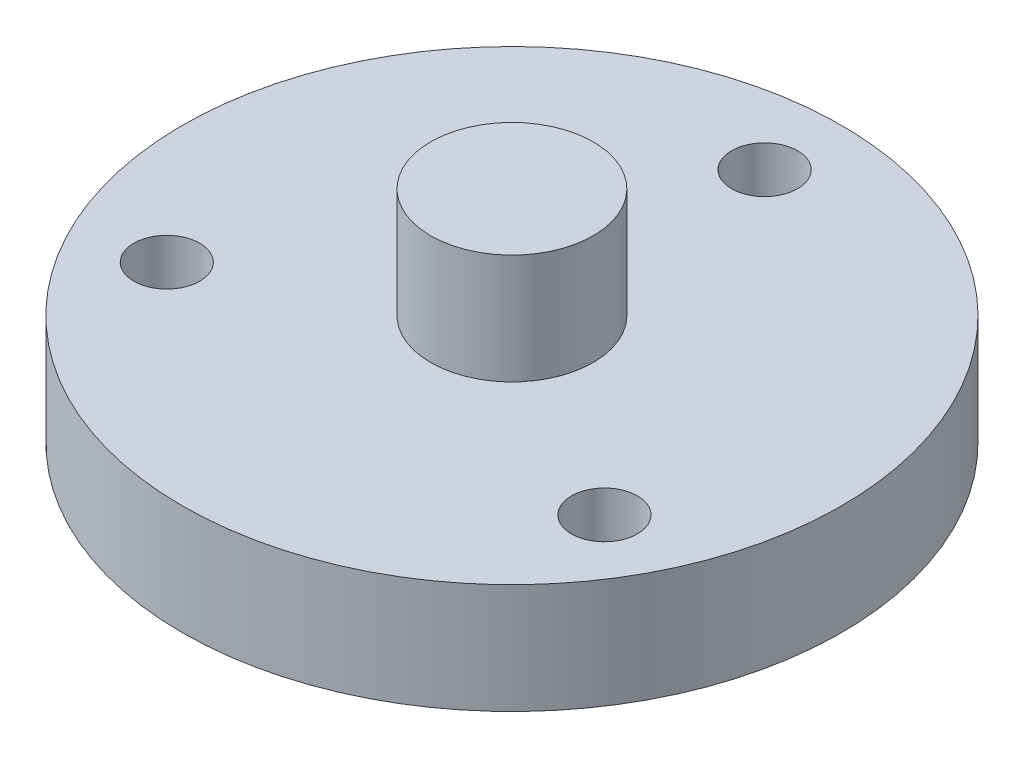
ISO-10303-21;
HEADER;
FILE_DESCRIPTION(('STEP AP214'),'2;1');
FILE_NAME('part.step','',(''),(''),'','','');
FILE_SCHEMA(('AUTOMOTIVE_DESIGN { 1 0 10303 214 1 1 1 1 }'));
ENDSEC;
DATA;
#1=APPLICATION_CONTEXT('core data for automotive mechanical design processes');
#2=APPLICATION_PROTOCOL_DEFINITION('international standard','automotive_design',2000,#1);
#3=PRODUCT_CONTEXT('',#1,'mechanical');
#4=PRODUCT('Part','Part','',(#3));
#5=PRODUCT_RELATED_PRODUCT_CATEGORY('part','',(#4));
#6=PRODUCT_DEFINITION_FORMATION('','',#4);
#7=PRODUCT_DEFINITION_CONTEXT('part definition',#1,'design');
#8=PRODUCT_DEFINITION('design','',#6,#7);
#9=PRODUCT_DEFINITION_SHAPE('','',#8);
#10=(LENGTH_UNIT() NAMED_UNIT(*) SI_UNIT(.MILLI.,.METRE.));
#11=(NAMED_UNIT(*) PLANE_ANGLE_UNIT() SI_UNIT($,.RADIAN.));
#12=(NAMED_UNIT(*) SI_UNIT($,.STERADIAN.) SOLID_ANGLE_UNIT());
#13=UNCERTAINTY_MEASURE_WITH_UNIT(LENGTH_MEASURE(1.E-05),#10,'distance_accuracy_value','');
#14=(GEOMETRIC_REPRESENTATION_CONTEXT(3) GLOBAL_UNCERTAINTY_ASSIGNED_CONTEXT((#13)) GLOBAL_UNIT_ASSIGNED_CONTEXT((#10,
#11,#12)) REPRESENTATION_CONTEXT('',''));
#15=CARTESIAN_POINT('',(0.,0.,0.));
#16=DIRECTION('',(0.,0.,1.));
#17=DIRECTION('',(1.,0.,0.));
#18=AXIS2_PLACEMENT_3D('',#15,#16,#17);
#19=CARTESIAN_POINT('',(0.,0.,0.));
#20=DIRECTION('',(0.,1.,0.));
#21=DIRECTION('',(0.,0.,1.));
#22=AXIS2_PLACEMENT_3D('',#19,#20,#21);
#23=PLANE('',#22);
#24=CARTESIAN_POINT('',(0.,0.,-23.));
#25=DIRECTION('',(0.,1.,0.));
#26=DIRECTION('',(0.,0.,1.));
#27=AXIS2_PLACEMENT_3D('',#24,#25,#26);
#28=CIRCLE('',#27,3.);
#29=CARTESIAN_POINT('',(0.,0.,-20.));
#30=VERTEX_POINT('',#29);
#31=EDGE_CURVE('E60',#30,#30,#28,.T.);
#32=ORIENTED_EDGE('',*,*,#31,.T.);
#33=EDGE_LOOP('',(#32));
#34=FACE_BOUND('',#33,.T.);
#35=CARTESIAN_POINT('',(19.918584287042,0.,11.5000000000001));
#36=DIRECTION('',(0.,1.,0.));
#37=DIRECTION('',(0.,0.,1.));
#38=AXIS2_PLACEMENT_3D('',#35,#36,#37);
#39=CIRCLE('',#38,3.);
#40=CARTESIAN_POINT('',(19.918584287042,0.,14.5000000000001));
#41=VERTEX_POINT('',#40);
#42=EDGE_CURVE('E73',#41,#41,#39,.T.);
#43=ORIENTED_EDGE('',*,*,#42,.T.);
#44=EDGE_LOOP('',(#43));
#45=FACE_BOUND('',#44,.T.);
#46=CARTESIAN_POINT('',(-19.918584287042,0.,11.5000000000001));
#47=DIRECTION('',(0.,1.,0.));
#48=DIRECTION('',(0.,0.,1.));
#49=AXIS2_PLACEMENT_3D('',#46,#47,#48);
#50=CIRCLE('',#49,3.);
#51=CARTESIAN_POINT('',(-19.918584287042,0.,14.5000000000001));
#52=VERTEX_POINT('',#51);
#53=EDGE_CURVE('E65',#52,#52,#50,.T.);
#54=ORIENTED_EDGE('',*,*,#53,.T.);
#55=EDGE_LOOP('',(#54));
#56=FACE_BOUND('',#55,.T.);
#57=CARTESIAN_POINT('',(0.,0.,0.));
#58=DIRECTION('',(0.,1.,0.));
#59=DIRECTION('',(0.,0.,1.));
#60=AXIS2_PLACEMENT_3D('',#57,#58,#59);
#61=CIRCLE('',#60,30.);
#62=CARTESIAN_POINT('',(0.,0.,30.));
#63=VERTEX_POINT('',#62);
#64=EDGE_CURVE('E10',#63,#63,#61,.T.);
#65=ORIENTED_EDGE('',*,*,#64,.F.);
#66=EDGE_LOOP('',(#65));
#67=FACE_BOUND('',#66,.T.);
#68=ADVANCED_FACE('F37',(#34,#45,#56,#67),#23,.F.);
#69=CARTESIAN_POINT('',(0.,30.2513966480447,0.));
#70=DIRECTION('',(0.,1.,0.));
#71=DIRECTION('',(0.,0.,1.));
#72=AXIS2_PLACEMENT_3D('',#69,#70,#71);
#73=CYLINDRICAL_SURFACE('',#72,30.);
#74=CARTESIAN_POINT('',(0.,10.,0.));
#75=DIRECTION('',(0.,1.,0.));
#76=DIRECTION('',(0.,0.,1.));
#77=AXIS2_PLACEMENT_3D('',#74,#75,#76);
#78=CIRCLE('',#77,30.);
#79=CARTESIAN_POINT('',(0.,10.,30.));
#80=VERTEX_POINT('',#79);
#81=EDGE_CURVE('E44',#80,#80,#78,.T.);
#82=ORIENTED_EDGE('',*,*,#81,.F.);
#83=EDGE_LOOP('',(#82));
#84=FACE_BOUND('',#83,.T.);
#85=ORIENTED_EDGE('',*,*,#64,.T.);
#86=EDGE_LOOP('',(#85));
#87=FACE_BOUND('',#86,.T.);
#88=ADVANCED_FACE('F98',(#84,#87),#73,.T.);
#89=CARTESIAN_POINT('',(30.,10.,0.));
#90=DIRECTION('',(0.,-1.,0.));
#91=DIRECTION('',(0.,0.,-1.));
#92=AXIS2_PLACEMENT_3D('',#89,#90,#91);
#93=PLANE('',#92);
#94=CARTESIAN_POINT('',(0.,10.,-23.));
#95=DIRECTION('',(0.,1.,0.));
#96=DIRECTION('',(0.,0.,1.));
#97=AXIS2_PLACEMENT_3D('',#94,#95,#96);
#98=CIRCLE('',#97,3.);
#99=CARTESIAN_POINT('',(0.,10.,-20.));
#100=VERTEX_POINT('',#99);
#101=EDGE_CURVE('E77',#100,#100,#98,.T.);
#102=ORIENTED_EDGE('',*,*,#101,.F.);
#103=EDGE_LOOP('',(#102));
#104=FACE_BOUND('',#103,.T.);
#105=CARTESIAN_POINT('',(19.918584287042,10.,11.5000000000001));
#106=DIRECTION('',(0.,1.,0.));
#107=DIRECTION('',(0.,0.,1.));
#108=AXIS2_PLACEMENT_3D('',#105,#106,#107);
#109=CIRCLE('',#108,3.);
#110=CARTESIAN_POINT('',(19.918584287042,10.,14.5000000000001));
#111=VERTEX_POINT('',#110);
#112=EDGE_CURVE('E69',#111,#111,#109,.T.);
#113=ORIENTED_EDGE('',*,*,#112,.F.);
#114=EDGE_LOOP('',(#113));
#115=FACE_BOUND('',#114,.T.);
#116=CARTESIAN_POINT('',(-19.918584287042,10.,11.5000000000001));
#117=DIRECTION('',(0.,1.,0.));
#118=DIRECTION('',(0.,0.,1.));
#119=AXIS2_PLACEMENT_3D('',#116,#117,#118);
#120=CIRCLE('',#119,3.);
#121=CARTESIAN_POINT('',(-19.918584287042,10.,14.5000000000001));
#122=VERTEX_POINT('',#121);
#123=EDGE_CURVE('E61',#122,#122,#120,.T.);
#124=ORIENTED_EDGE('',*,*,#123,.F.);
#125=EDGE_LOOP('',(#124));
#126=FACE_BOUND('',#125,.T.);
#127=CARTESIAN_POINT('',(0.,9.99999999999999,0.));
#128=DIRECTION('',(0.,1.,0.));
#129=DIRECTION('',(0.,0.,1.));
#130=AXIS2_PLACEMENT_3D('',#127,#128,#129);
#131=CIRCLE('',#130,7.4);
#132=CARTESIAN_POINT('',(0.,9.99999999999999,7.4));
#133=VERTEX_POINT('',#132);
#134=EDGE_CURVE('E49',#133,#133,#131,.T.);
#135=ORIENTED_EDGE('',*,*,#134,.F.);
#136=EDGE_LOOP('',(#135));
#137=FACE_BOUND('',#136,.T.);
#138=ORIENTED_EDGE('',*,*,#81,.T.);
#139=EDGE_LOOP('',(#138));
#140=FACE_BOUND('',#139,.T.);
#141=ADVANCED_FACE('F94',(#104,#115,#126,#137,#140),#93,.F.);
#142=CARTESIAN_POINT('',(0.,30.2513966480447,0.));
#143=DIRECTION('',(0.,1.,0.));
#144=DIRECTION('',(0.,0.,1.));
#145=AXIS2_PLACEMENT_3D('',#142,#143,#144);
#146=CYLINDRICAL_SURFACE('',#145,7.4);
#147=CARTESIAN_POINT('',(0.,20.,0.));
#148=DIRECTION('',(0.,1.,0.));
#149=DIRECTION('',(0.,0.,1.));
#150=AXIS2_PLACEMENT_3D('',#147,#148,#149);
#151=CIRCLE('',#150,7.4);
#152=CARTESIAN_POINT('',(0.,20.,7.4));
#153=VERTEX_POINT('',#152);
#154=EDGE_CURVE('E54',#153,#153,#151,.T.);
#155=ORIENTED_EDGE('',*,*,#154,.F.);
#156=EDGE_LOOP('',(#155));
#157=FACE_BOUND('',#156,.T.);
#158=ORIENTED_EDGE('',*,*,#134,.T.);
#159=EDGE_LOOP('',(#158));
#160=FACE_BOUND('',#159,.T.);
#161=ADVANCED_FACE('F97',(#157,#160),#146,.T.);
#162=CARTESIAN_POINT('',(7.4,20.,0.));
#163=DIRECTION('',(0.,-1.,0.));
#164=DIRECTION('',(0.,0.,-1.));
#165=AXIS2_PLACEMENT_3D('',#162,#163,#164);
#166=PLANE('',#165);
#167=ORIENTED_EDGE('',*,*,#154,.T.);
#168=EDGE_LOOP('',(#167));
#169=FACE_BOUND('',#168,.T.);
#170=ADVANCED_FACE('F107',(#169),#166,.F.);
#171=CARTESIAN_POINT('',(-19.918584287042,0.,11.5000000000001));
#172=DIRECTION('',(0.,1.,0.));
#173=DIRECTION('',(0.,0.,1.));
#174=AXIS2_PLACEMENT_3D('',#171,#172,#173);
#175=CYLINDRICAL_SURFACE('',#174,3.);
#176=ORIENTED_EDGE('',*,*,#53,.F.);
#177=EDGE_LOOP('',(#176));
#178=FACE_BOUND('',#177,.T.);
#179=ORIENTED_EDGE('',*,*,#123,.T.);
#180=EDGE_LOOP('',(#179));
#181=FACE_BOUND('',#180,.T.);
#182=ADVANCED_FACE('F113',(#178,#181),#175,.F.);
#183=CARTESIAN_POINT('',(19.918584287042,0.,11.5000000000001));
#184=DIRECTION('',(0.,1.,0.));
#185=DIRECTION('',(0.,0.,1.));
#186=AXIS2_PLACEMENT_3D('',#183,#184,#185);
#187=CYLINDRICAL_SURFACE('',#186,3.);
#188=ORIENTED_EDGE('',*,*,#42,.F.);
#189=EDGE_LOOP('',(#188));
#190=FACE_BOUND('',#189,.T.);
#191=ORIENTED_EDGE('',*,*,#112,.T.);
#192=EDGE_LOOP('',(#191));
#193=FACE_BOUND('',#192,.T.);
#194=ADVANCED_FACE('F90',(#190,#193),#187,.F.);
#195=CARTESIAN_POINT('',(0.,0.,-23.));
#196=DIRECTION('',(0.,1.,0.));
#197=DIRECTION('',(0.,0.,1.));
#198=AXIS2_PLACEMENT_3D('',#195,#196,#197);
#199=CYLINDRICAL_SURFACE('',#198,3.);
#200=ORIENTED_EDGE('',*,*,#31,.F.);
#201=EDGE_LOOP('',(#200));
#202=FACE_BOUND('',#201,.T.);
#203=ORIENTED_EDGE('',*,*,#101,.T.);
#204=EDGE_LOOP('',(#203));
#205=FACE_BOUND('',#204,.T.);
#206=ADVANCED_FACE('F87',(#202,#205),#199,.F.);
#207=CLOSED_SHELL('',(#68,#88,#141,#161,#170,#182,#194,#206));
#208=MANIFOLD_SOLID_BREP('B2',#207);
#209=ADVANCED_BREP_SHAPE_REPRESENTATION('',(#18,#208),#14);
#210=SHAPE_DEFINITION_REPRESENTATION(#9,#209);
ENDSEC;
END-ISO-10303-21;
